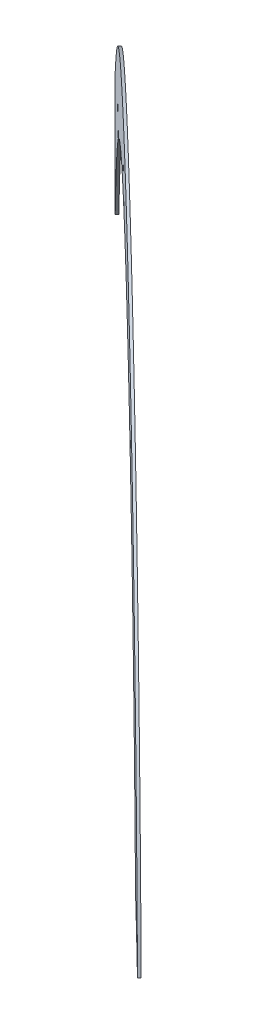
ISO-10303-21;
HEADER;
FILE_DESCRIPTION(('STEP AP214'),'2;1');
FILE_NAME('part.step','',(''),(''),'','','');
FILE_SCHEMA(('AUTOMOTIVE_DESIGN { 1 0 10303 214 1 1 1 1 }'));
ENDSEC;
DATA;
#1=APPLICATION_CONTEXT('core data for automotive mechanical design processes');
#2=APPLICATION_PROTOCOL_DEFINITION('international standard','automotive_design',2000,#1);
#3=PRODUCT_CONTEXT('',#1,'mechanical');
#4=PRODUCT('Part','Part','',(#3));
#5=PRODUCT_RELATED_PRODUCT_CATEGORY('part','',(#4));
#6=PRODUCT_DEFINITION_FORMATION('','',#4);
#7=PRODUCT_DEFINITION_CONTEXT('part definition',#1,'design');
#8=PRODUCT_DEFINITION('design','',#6,#7);
#9=PRODUCT_DEFINITION_SHAPE('','',#8);
#10=(LENGTH_UNIT() NAMED_UNIT(*) SI_UNIT(.MILLI.,.METRE.));
#11=(NAMED_UNIT(*) PLANE_ANGLE_UNIT() SI_UNIT($,.RADIAN.));
#12=(NAMED_UNIT(*) SI_UNIT($,.STERADIAN.) SOLID_ANGLE_UNIT());
#13=UNCERTAINTY_MEASURE_WITH_UNIT(LENGTH_MEASURE(1.E-05),#10,'distance_accuracy_value','');
#14=(GEOMETRIC_REPRESENTATION_CONTEXT(3) GLOBAL_UNCERTAINTY_ASSIGNED_CONTEXT((#13)) GLOBAL_UNIT_ASSIGNED_CONTEXT((#10,
#11,#12)) REPRESENTATION_CONTEXT('',''));
#15=CARTESIAN_POINT('',(0.,0.,0.));
#16=DIRECTION('',(0.,0.,1.));
#17=DIRECTION('',(1.,0.,0.));
#18=AXIS2_PLACEMENT_3D('',#15,#16,#17);
#19=CARTESIAN_POINT('',(-163.082588536067,0.,169.399508697981));
#20=DIRECTION('',(-0.693547097638021,0.,0.720411287639136));
#21=DIRECTION('',(0.720411287639136,0.,0.693547097638021));
#22=AXIS2_PLACEMENT_3D('',#19,#20,#21);
#23=CYLINDRICAL_SURFACE('',#22,298.478991770015);
#24=CARTESIAN_POINT('',(-164.227634794267,0.,170.588907733874));
#25=DIRECTION('',(-0.693547097638021,0.,0.720411287639136));
#26=DIRECTION('',(0.720411287639136,0.,0.693547097638021));
#27=AXIS2_PLACEMENT_3D('',#24,#25,#26);
#28=CIRCLE('',#27,298.478991770015);
#29=CARTESIAN_POINT('',(46.3376907785851,60.4918045135721,373.302236800156));
#30=VERTEX_POINT('',#29);
#31=CARTESIAN_POINT('',(-338.078037832069,175.652676961867,3.2213990358922));
#32=VERTEX_POINT('',#31);
#33=EDGE_CURVE('E38',#30,#32,#28,.T.);
#34=ORIENTED_EDGE('',*,*,#33,.F.);
#35=DIRECTION('',(0.693547097638021,0.,-0.720411287639136));
#36=VECTOR('',#35,1.);
#37=CARTESIAN_POINT('',(46.3376907785852,60.4918045135721,373.302236800156));
#38=LINE('',#37,#36);
#39=CARTESIAN_POINT('',(47.4827370367855,60.4918045135721,372.112837764264));
#40=VERTEX_POINT('',#39);
#41=EDGE_CURVE('E189',#30,#40,#38,.T.);
#42=ORIENTED_EDGE('',*,*,#41,.T.);
#43=CARTESIAN_POINT('',(-163.082588536067,0.,169.399508697981));
#44=DIRECTION('',(-0.693547097638021,0.,0.720411287639136));
#45=DIRECTION('',(0.720411287639136,0.,0.693547097638021));
#46=AXIS2_PLACEMENT_3D('',#43,#44,#45);
#47=CIRCLE('',#46,298.478991770015);
#48=CARTESIAN_POINT('',(-336.932991573868,175.652676961867,2.03199999999998));
#49=VERTEX_POINT('',#48);
#50=EDGE_CURVE('E280',#40,#49,#47,.T.);
#51=ORIENTED_EDGE('',*,*,#50,.T.);
#52=DIRECTION('',(-0.693547097638021,0.,0.720411287639136));
#53=VECTOR('',#52,1.);
#54=CARTESIAN_POINT('',(-336.932991573868,175.652676961867,2.03200000000001));
#55=LINE('',#54,#53);
#56=EDGE_CURVE('E178',#49,#32,#55,.T.);
#57=ORIENTED_EDGE('',*,*,#56,.T.);
#58=EDGE_LOOP('',(#34,#42,#51,#57));
#59=FACE_BOUND('',#58,.T.);
#60=ADVANCED_FACE('F31',(#59),#23,.T.);
#61=CARTESIAN_POINT('',(-163.082588536067,0.,169.399508697981));
#62=DIRECTION('',(-0.693547097638021,0.,0.720411287639136));
#63=DIRECTION('',(0.720411287639136,0.,0.693547097638021));
#64=AXIS2_PLACEMENT_3D('',#61,#62,#63);
#65=CYLINDRICAL_SURFACE('',#64,257.203991770015);
#66=DIRECTION('',(0.693547097638021,0.,-0.720411287639136));
#67=VECTOR('',#66,1.);
#68=CARTESIAN_POINT('',(12.9939765678767,75.0839301911765,341.201912149368));
#69=LINE('',#68,#67);
#70=CARTESIAN_POINT('',(12.9939765678767,75.0839301911765,341.201912149368));
#71=VERTEX_POINT('',#70);
#72=CARTESIAN_POINT('',(14.139022826077,75.0839301911765,340.012513113476));
#73=VERTEX_POINT('',#72);
#74=EDGE_CURVE('E197',#71,#73,#69,.T.);
#75=ORIENTED_EDGE('',*,*,#74,.F.);
#76=CARTESIAN_POINT('',(-164.227634794267,0.,170.588907733874));
#77=DIRECTION('',(-0.693547097638021,0.,0.720411287639136));
#78=DIRECTION('',(0.720411287639136,0.,0.693547097638021));
#79=AXIS2_PLACEMENT_3D('',#76,#77,#78);
#80=CIRCLE('',#79,257.203991770015);
#81=CARTESIAN_POINT('',(-2.4980018054066E-13,119.106830955406,328.692481925197));
#82=VERTEX_POINT('',#81);
#83=EDGE_CURVE('E284',#71,#82,#80,.T.);
#84=ORIENTED_EDGE('',*,*,#83,.T.);
#85=DIRECTION('',(0.693547097638021,0.,-0.720411287639136));
#86=VECTOR('',#85,1.);
#87=CARTESIAN_POINT('',(-2.77555756156289E-13,119.106830955406,328.692481925197));
#88=LINE('',#87,#86);
#89=CARTESIAN_POINT('',(1.14504625820011,119.106830955406,327.503082889304));
#90=VERTEX_POINT('',#89);
#91=EDGE_CURVE('E380',#82,#90,#88,.T.);
#92=ORIENTED_EDGE('',*,*,#91,.T.);
#93=CARTESIAN_POINT('',(-163.082588536067,0.,169.399508697981));
#94=DIRECTION('',(-0.693547097638021,0.,0.720411287639136));
#95=DIRECTION('',(0.720411287639136,0.,0.693547097638021));
#96=AXIS2_PLACEMENT_3D('',#93,#94,#95);
#97=CIRCLE('',#96,257.203991770015);
#98=EDGE_CURVE('E183',#73,#90,#97,.T.);
#99=ORIENTED_EDGE('',*,*,#98,.F.);
#100=EDGE_LOOP('',(#75,#84,#92,#99));
#101=FACE_BOUND('',#100,.T.);
#102=ADVANCED_FACE('F261',(#101),#65,.F.);
#103=CARTESIAN_POINT('',(-163.082588536067,0.,169.399508697981));
#104=DIRECTION('',(-0.693547097638021,0.,0.720411287639136));
#105=DIRECTION('',(0.720411287639136,0.,0.693547097638021));
#106=AXIS2_PLACEMENT_3D('',#103,#104,#105);
#107=PLANE('',#106);
#108=CARTESIAN_POINT('',(-278.7952938408,200.885539681433,58.0017387006007));
#109=VERTEX_POINT('',#108);
#110=CARTESIAN_POINT('',(-331.248318602606,108.001151140404,7.5046910972765));
#111=VERTEX_POINT('',#110);
#112=EDGE_CURVE('E187',#109,#111,#97,.T.);
#113=ORIENTED_EDGE('',*,*,#112,.T.);
#114=DIRECTION('',(-0.701450777031492,0.227915173395404,-0.675293625868081));
#115=VECTOR('',#114,1.);
#116=CARTESIAN_POINT('',(-154.551730465137,50.5889493973883,177.612250442832));
#117=LINE('',#116,#115);
#118=CARTESIAN_POINT('',(-336.932991573868,109.84821335541,2.03199999999992));
#119=VERTEX_POINT('',#118);
#120=EDGE_CURVE('E185',#111,#119,#117,.T.);
#121=ORIENTED_EDGE('',*,*,#120,.T.);
#122=DIRECTION('',(0.,1.,0.));
#123=VECTOR('',#122,1.);
#124=CARTESIAN_POINT('',(-336.932991573868,0.,2.03200000000001));
#125=LINE('',#124,#123);
#126=EDGE_CURVE('E174',#119,#49,#125,.T.);
#127=ORIENTED_EDGE('',*,*,#126,.T.);
#128=ORIENTED_EDGE('',*,*,#50,.F.);
#129=CARTESIAN_POINT('',(1.14504625820033,0.,327.503082889305));
#130=DIRECTION('',(-0.693547097638021,0.,0.720411287639136));
#131=DIRECTION('',(-0.720411287639136,0.,-0.693547097638021));
#132=AXIS2_PLACEMENT_3D('',#129,#130,#131);
#133=ELLIPSE('',#132,105.772912373036,76.2);
#134=EDGE_CURVE('E400',#73,#40,#133,.F.);
#135=ORIENTED_EDGE('',*,*,#134,.F.);
#136=ORIENTED_EDGE('',*,*,#98,.T.);
#137=DIRECTION('',(0.,1.,0.));
#138=VECTOR('',#137,1.);
#139=CARTESIAN_POINT('',(1.14504625820008,0.,327.503082889304));
#140=LINE('',#139,#138);
#141=CARTESIAN_POINT('',(1.14504625820012,153.85068584765,327.503082889304));
#142=VERTEX_POINT('',#141);
#143=EDGE_CURVE('E370',#90,#142,#140,.T.);
#144=ORIENTED_EDGE('',*,*,#143,.T.);
#145=CARTESIAN_POINT('',(0.572523129099984,153.85068584765,326.951909189876));
#146=DIRECTION('',(-0.693547097638021,0.,0.720411287639136));
#147=DIRECTION('',(0.720411287639136,0.,0.693547097638021));
#148=AXIS2_PLACEMENT_3D('',#145,#146,#147);
#149=CIRCLE('',#148,0.79471704417121);
#150=CARTESIAN_POINT('',(-2.31955307493579E-13,153.85068584765,326.400735490448));
#151=VERTEX_POINT('',#150);
#152=EDGE_CURVE('E376',#142,#151,#149,.T.);
#153=ORIENTED_EDGE('',*,*,#152,.T.);
#154=DIRECTION('',(0.,-1.,0.));
#155=VECTOR('',#154,1.);
#156=CARTESIAN_POINT('',(0.,4.17063620840154E-13,326.400735490448));
#157=LINE('',#156,#155);
#158=CARTESIAN_POINT('',(-1.34303677970628E-13,122.10068584765,326.400735490448));
#159=VERTEX_POINT('',#158);
#160=EDGE_CURVE('E378',#151,#159,#157,.T.);
#161=ORIENTED_EDGE('',*,*,#160,.T.);
#162=CARTESIAN_POINT('',(-71.2756377694648,223.413832775681,257.782971505505));
#163=VERTEX_POINT('',#162);
#164=EDGE_CURVE('E283',#159,#163,#97,.T.);
#165=ORIENTED_EDGE('',*,*,#164,.T.);
#166=DIRECTION('',(-0.296188126760788,0.911573321638445,-0.285143249688621));
#167=VECTOR('',#166,1.);
#168=CARTESIAN_POINT('',(-26.4730330924004,85.5255939385098,300.914883752785));
#169=LINE('',#168,#167);
#170=CARTESIAN_POINT('',(-81.5457039240239,255.021846305267,247.895876874621));
#171=VERTEX_POINT('',#170);
#172=EDGE_CURVE('E344',#163,#171,#169,.T.);
#173=ORIENTED_EDGE('',*,*,#172,.T.);
#174=CARTESIAN_POINT('',(-82.1634388218282,254.635108028727,247.301177356675));
#175=DIRECTION('',(-0.693547097638021,0.,0.720411287639136));
#176=DIRECTION('',(0.720411287639136,0.,0.693547097638021));
#177=AXIS2_PLACEMENT_3D('',#174,#175,#176);
#178=CIRCLE('',#177,0.940654248463459);
#179=CARTESIAN_POINT('',(-82.7811737196327,254.248369752186,246.706477838729));
#180=VERTEX_POINT('',#179);
#181=EDGE_CURVE('E351',#171,#180,#178,.T.);
#182=ORIENTED_EDGE('',*,*,#181,.T.);
#183=DIRECTION('',(0.29618812676079,-0.911573321638444,0.285143249688622));
#184=VECTOR('',#183,1.);
#185=CARTESIAN_POINT('',(-27.708502888009,84.7521173854291,299.725484716893));
#186=LINE('',#185,#184);
#187=CARTESIAN_POINT('',(-73.2675602432636,224.968478176917,255.865327967533));
#188=VERTEX_POINT('',#187);
#189=EDGE_CURVE('E353',#180,#188,#186,.T.);
#190=ORIENTED_EDGE('',*,*,#189,.T.);
#191=CARTESIAN_POINT('',(-183.871257537417,255.580097273569,149.38605069555));
#192=VERTEX_POINT('',#191);
#193=EDGE_CURVE('E416',#188,#192,#97,.T.);
#194=ORIENTED_EDGE('',*,*,#193,.T.);
#195=DIRECTION('',(0.51156164963066,-0.704104205758041,0.492485478020414));
#196=VECTOR('',#195,1.);
#197=CARTESIAN_POINT('',(-81.3307482807189,114.445194216746,248.102816806148));
#198=LINE('',#197,#196);
#199=CARTESIAN_POINT('',(-197.305171885825,274.070294103877,136.4530880031));
#200=VERTEX_POINT('',#199);
#201=EDGE_CURVE('E327',#200,#192,#198,.T.);
#202=ORIENTED_EDGE('',*,*,#201,.F.);
#203=CARTESIAN_POINT('',(-197.92290678363,273.205521028032,135.858388485154));
#204=DIRECTION('',(-0.693547097638021,0.,0.720411287639136));
#205=DIRECTION('',(0.720411287639136,0.,0.693547097638021));
#206=AXIS2_PLACEMENT_3D('',#203,#204,#205);
#207=CIRCLE('',#206,1.21782445094457);
#208=CARTESIAN_POINT('',(-198.540641681434,272.340747952186,135.263688967208));
#209=VERTEX_POINT('',#208);
#210=EDGE_CURVE('E325',#209,#200,#207,.F.);
#211=ORIENTED_EDGE('',*,*,#210,.F.);
#212=DIRECTION('',(-0.511561649630659,0.704104205758043,-0.492485478020413));
#213=VECTOR('',#212,1.);
#214=CARTESIAN_POINT('',(-82.5662180763276,112.715648065053,246.913417770256));
#215=LINE('',#214,#213);
#216=CARTESIAN_POINT('',(-186.09621595238,255.21246536807,147.244061143831));
#217=VERTEX_POINT('',#216);
#218=EDGE_CURVE('E319',#217,#209,#215,.T.);
#219=ORIENTED_EDGE('',*,*,#218,.F.);
#220=CARTESIAN_POINT('',(-276.50004292002,203.392062881473,60.2113995454144));
#221=VERTEX_POINT('',#220);
#222=EDGE_CURVE('E292',#217,#221,#97,.T.);
#223=ORIENTED_EDGE('',*,*,#222,.T.);
#224=DIRECTION('',(-0.638267967412969,0.463728822589056,-0.614466907875994));
#225=VECTOR('',#224,1.);
#226=CARTESIAN_POINT('',(-127.271734922929,94.9713507393051,203.874972941085));
#227=LINE('',#226,#225);
#228=CARTESIAN_POINT('',(-290.888121899911,213.845614156663,46.3598530909002));
#229=VERTEX_POINT('',#228);
#230=EDGE_CURVE('E296',#221,#229,#227,.T.);
#231=ORIENTED_EDGE('',*,*,#230,.T.);
#232=CARTESIAN_POINT('',(-291.505856797715,212.207364527736,45.7651535729541));
#233=DIRECTION('',(-0.693547097638021,0.,0.720411287639136));
#234=DIRECTION('',(0.720411287639136,0.,0.693547097638021));
#235=AXIS2_PLACEMENT_3D('',#232,#233,#234);
#236=CIRCLE('',#235,1.84908782032938);
#237=CARTESIAN_POINT('',(-292.12359169552,210.569114898809,45.1704540550079));
#238=VERTEX_POINT('',#237);
#239=EDGE_CURVE('E297',#229,#238,#236,.T.);
#240=ORIENTED_EDGE('',*,*,#239,.T.);
#241=DIRECTION('',(0.638267967412969,-0.463728822589056,0.614466907875994));
#242=VECTOR('',#241,1.);
#243=CARTESIAN_POINT('',(-128.507204718538,91.6948514814512,202.685573905193));
#244=LINE('',#243,#242);
#245=EDGE_CURVE('E300',#238,#109,#244,.T.);
#246=ORIENTED_EDGE('',*,*,#245,.T.);
#247=EDGE_LOOP('',(#113,#121,#127,#128,#135,#136,#144,#153,#161,#165,#173,#182,#190,#194,#202,
#211,#219,#223,#231,#240,#246));
#248=FACE_BOUND('',#247,.T.);
#249=ADVANCED_FACE('F186',(#248),#107,.F.);
#250=CARTESIAN_POINT('',(-164.227634794267,0.,170.588907733874));
#251=DIRECTION('',(-0.693547097638021,0.,0.720411287639136));
#252=DIRECTION('',(0.720411287639136,0.,0.693547097638021));
#253=AXIS2_PLACEMENT_3D('',#250,#251,#252);
#254=PLANE('',#253);
#255=DIRECTION('',(-0.701450777031492,0.227915173395404,-0.675293625868081));
#256=VECTOR('',#255,1.);
#257=CARTESIAN_POINT('',(-155.696776723338,50.5889493973883,178.801649478724));
#258=LINE('',#257,#256);
#259=CARTESIAN_POINT('',(-332.393364860806,108.001151140404,8.69409013316871));
#260=VERTEX_POINT('',#259);
#261=CARTESIAN_POINT('',(-338.078037832069,109.84821335541,3.22139903589219));
#262=VERTEX_POINT('',#261);
#263=EDGE_CURVE('E45',#260,#262,#258,.T.);
#264=ORIENTED_EDGE('',*,*,#263,.F.);
#265=CARTESIAN_POINT('',(-279.940340099001,200.885539681433,59.1911377364929));
#266=VERTEX_POINT('',#265);
#267=EDGE_CURVE('E287',#266,#260,#80,.T.);
#268=ORIENTED_EDGE('',*,*,#267,.F.);
#269=DIRECTION('',(-0.638267967412969,0.463728822589056,-0.614466907875994));
#270=VECTOR('',#269,1.);
#271=CARTESIAN_POINT('',(-279.940340099001,200.885539681433,59.1911377364929));
#272=LINE('',#271,#270);
#273=CARTESIAN_POINT('',(-293.26863795372,210.569114898809,46.3598530909002));
#274=VERTEX_POINT('',#273);
#275=EDGE_CURVE('E315',#266,#274,#272,.T.);
#276=ORIENTED_EDGE('',*,*,#275,.T.);
#277=CARTESIAN_POINT('',(-292.650903055916,212.207364527736,46.9545526088463));
#278=DIRECTION('',(0.693547097638021,0.,-0.720411287639136));
#279=DIRECTION('',(-0.720411287639136,0.,-0.693547097638021));
#280=AXIS2_PLACEMENT_3D('',#277,#278,#279);
#281=CIRCLE('',#280,1.84908782032938);
#282=CARTESIAN_POINT('',(-292.033168158111,213.845614156663,47.5492521267924));
#283=VERTEX_POINT('',#282);
#284=EDGE_CURVE('E311',#274,#283,#281,.T.);
#285=ORIENTED_EDGE('',*,*,#284,.T.);
#286=DIRECTION('',(0.638267967412969,-0.463728822589056,0.614466907875993));
#287=VECTOR('',#286,1.);
#288=CARTESIAN_POINT('',(-277.645089178221,203.392062881473,61.4007985813066));
#289=LINE('',#288,#287);
#290=CARTESIAN_POINT('',(-277.645089178221,203.392062881473,61.4007985813066));
#291=VERTEX_POINT('',#290);
#292=EDGE_CURVE('E307',#283,#291,#289,.T.);
#293=ORIENTED_EDGE('',*,*,#292,.T.);
#294=CARTESIAN_POINT('',(-187.241262210581,255.21246536807,148.433460179723));
#295=VERTEX_POINT('',#294);
#296=EDGE_CURVE('E294',#295,#291,#80,.T.);
#297=ORIENTED_EDGE('',*,*,#296,.F.);
#298=DIRECTION('',(0.511561649630659,-0.704104205758043,0.492485478020413));
#299=VECTOR('',#298,1.);
#300=CARTESIAN_POINT('',(-187.241262210581,255.21246536807,148.433460179723));
#301=LINE('',#300,#299);
#302=CARTESIAN_POINT('',(-199.685687939634,272.340747952186,136.4530880031));
#303=VERTEX_POINT('',#302);
#304=EDGE_CURVE('E332',#303,#295,#301,.T.);
#305=ORIENTED_EDGE('',*,*,#304,.F.);
#306=CARTESIAN_POINT('',(-199.06795304183,273.205521028032,137.047787521046));
#307=DIRECTION('',(-0.693547097638021,0.,0.720411287639136));
#308=DIRECTION('',(-0.720411287639136,0.,-0.693547097638021));
#309=AXIS2_PLACEMENT_3D('',#306,#307,#308);
#310=CIRCLE('',#309,1.21782445094457);
#311=CARTESIAN_POINT('',(-198.450218144026,274.070294103877,137.642487038992));
#312=VERTEX_POINT('',#311);
#313=EDGE_CURVE('E336',#312,#303,#310,.T.);
#314=ORIENTED_EDGE('',*,*,#313,.F.);
#315=DIRECTION('',(-0.51156164963066,0.704104205758041,-0.492485478020414));
#316=VECTOR('',#315,1.);
#317=CARTESIAN_POINT('',(-185.016303795617,255.580097273569,150.575449731442));
#318=LINE('',#317,#316);
#319=CARTESIAN_POINT('',(-185.016303795617,255.580097273569,150.575449731442));
#320=VERTEX_POINT('',#319);
#321=EDGE_CURVE('E340',#320,#312,#318,.T.);
#322=ORIENTED_EDGE('',*,*,#321,.F.);
#323=CARTESIAN_POINT('',(-74.4126065014641,224.968478176917,257.054727003425));
#324=VERTEX_POINT('',#323);
#325=EDGE_CURVE('E293',#324,#320,#80,.T.);
#326=ORIENTED_EDGE('',*,*,#325,.F.);
#327=DIRECTION('',(-0.29618812676079,0.911573321638444,-0.285143249688622));
#328=VECTOR('',#327,1.);
#329=CARTESIAN_POINT('',(-74.4126065014641,224.968478176917,257.054727003425));
#330=LINE('',#329,#328);
#331=CARTESIAN_POINT('',(-83.926219977833,254.248369752186,247.895876874621));
#332=VERTEX_POINT('',#331);
#333=EDGE_CURVE('E366',#324,#332,#330,.T.);
#334=ORIENTED_EDGE('',*,*,#333,.T.);
#335=CARTESIAN_POINT('',(-83.3084850800286,254.635108028727,248.490576392567));
#336=DIRECTION('',(0.693547097638021,0.,-0.720411287639136));
#337=DIRECTION('',(-0.720411287639136,0.,-0.693547097638021));
#338=AXIS2_PLACEMENT_3D('',#335,#336,#337);
#339=CIRCLE('',#338,0.940654248463459);
#340=CARTESIAN_POINT('',(-82.6907501822242,255.021846305267,249.085275910513));
#341=VERTEX_POINT('',#340);
#342=EDGE_CURVE('E362',#332,#341,#339,.T.);
#343=ORIENTED_EDGE('',*,*,#342,.T.);
#344=DIRECTION('',(0.296188126760788,-0.911573321638445,0.28514324968862));
#345=VECTOR('',#344,1.);
#346=CARTESIAN_POINT('',(-72.4206840276652,223.413832775681,258.972370541397));
#347=LINE('',#346,#345);
#348=CARTESIAN_POINT('',(-72.4206840276651,223.413832775681,258.972370541397));
#349=VERTEX_POINT('',#348);
#350=EDGE_CURVE('E358',#341,#349,#347,.T.);
#351=ORIENTED_EDGE('',*,*,#350,.T.);
#352=CARTESIAN_POINT('',(-1.14504625820053,122.10068584765,327.59013452634));
#353=VERTEX_POINT('',#352);
#354=EDGE_CURVE('E286',#353,#349,#80,.T.);
#355=ORIENTED_EDGE('',*,*,#354,.F.);
#356=DIRECTION('',(0.,1.,0.));
#357=VECTOR('',#356,1.);
#358=CARTESIAN_POINT('',(-1.14504625820053,122.10068584765,327.59013452634));
#359=LINE('',#358,#357);
#360=CARTESIAN_POINT('',(-1.14504625820059,153.85068584765,327.59013452634));
#361=VERTEX_POINT('',#360);
#362=EDGE_CURVE('E390',#353,#361,#359,.T.);
#363=ORIENTED_EDGE('',*,*,#362,.T.);
#364=CARTESIAN_POINT('',(-0.572523129100416,153.85068584765,328.141308225768));
#365=DIRECTION('',(0.693547097638021,0.,-0.720411287639136));
#366=DIRECTION('',(0.720411287639136,0.,0.693547097638021));
#367=AXIS2_PLACEMENT_3D('',#364,#365,#366);
#368=CIRCLE('',#367,0.79471704417121);
#369=CARTESIAN_POINT('',(-2.53161207275365E-13,153.85068584765,328.692481925197));
#370=VERTEX_POINT('',#369);
#371=EDGE_CURVE('E386',#361,#370,#368,.T.);
#372=ORIENTED_EDGE('',*,*,#371,.T.);
#373=DIRECTION('',(0.,-1.,0.));
#374=VECTOR('',#373,1.);
#375=CARTESIAN_POINT('',(-2.77555756156289E-13,119.106830955406,328.692481925197));
#376=LINE('',#375,#374);
#377=EDGE_CURVE('E382',#370,#82,#376,.T.);
#378=ORIENTED_EDGE('',*,*,#377,.T.);
#379=ORIENTED_EDGE('',*,*,#83,.F.);
#380=CARTESIAN_POINT('',(0.,0.,328.692481925197));
#381=DIRECTION('',(-0.693547097638021,0.,0.720411287639136));
#382=DIRECTION('',(-0.720411287639136,0.,-0.693547097638021));
#383=AXIS2_PLACEMENT_3D('',#380,#381,#382);
#384=ELLIPSE('',#383,105.772912373035,76.2);
#385=EDGE_CURVE('E182',#71,#30,#384,.F.);
#386=ORIENTED_EDGE('',*,*,#385,.T.);
#387=ORIENTED_EDGE('',*,*,#33,.T.);
#388=DIRECTION('',(0.,-1.,0.));
#389=VECTOR('',#388,1.);
#390=CARTESIAN_POINT('',(-338.078037832069,0.,3.22139903589219));
#391=LINE('',#390,#389);
#392=EDGE_CURVE('E394',#32,#262,#391,.T.);
#393=ORIENTED_EDGE('',*,*,#392,.T.);
#394=EDGE_LOOP('',(#264,#268,#276,#285,#293,#297,#305,#314,#322,#326,#334,#343,#351,#355,#363,
#372,#378,#379,#386,#387,#393));
#395=FACE_BOUND('',#394,.T.);
#396=ADVANCED_FACE('F260',(#395),#254,.T.);
#397=ORIENTED_EDGE('',*,*,#267,.T.);
#398=DIRECTION('',(0.693547097638021,0.,-0.720411287639136));
#399=VECTOR('',#398,1.);
#400=CARTESIAN_POINT('',(-840.224699090093,108.001151140404,536.196009817599));
#401=LINE('',#400,#399);
#402=EDGE_CURVE('E52',#260,#111,#401,.T.);
#403=ORIENTED_EDGE('',*,*,#402,.T.);
#404=ORIENTED_EDGE('',*,*,#112,.F.);
#405=DIRECTION('',(0.693547097638021,0.,-0.720411287639136));
#406=VECTOR('',#405,1.);
#407=CARTESIAN_POINT('',(-279.940340099001,200.885539681433,59.1911377364929));
#408=LINE('',#407,#406);
#409=EDGE_CURVE('E316',#266,#109,#408,.T.);
#410=ORIENTED_EDGE('',*,*,#409,.F.);
#411=EDGE_LOOP('',(#397,#403,#404,#410));
#412=FACE_BOUND('',#411,.T.);
#413=ADVANCED_FACE('F256',(#412),#65,.F.);
#414=ORIENTED_EDGE('',*,*,#164,.F.);
#415=DIRECTION('',(0.693547097638021,0.,-0.720411287639136));
#416=VECTOR('',#415,1.);
#417=CARTESIAN_POINT('',(-1.14504625820053,122.10068584765,327.59013452634));
#418=LINE('',#417,#416);
#419=EDGE_CURVE('E391',#353,#159,#418,.T.);
#420=ORIENTED_EDGE('',*,*,#419,.F.);
#421=ORIENTED_EDGE('',*,*,#354,.T.);
#422=DIRECTION('',(0.693547097638021,0.,-0.720411287639136));
#423=VECTOR('',#422,1.);
#424=CARTESIAN_POINT('',(-72.4206840276652,223.413832775681,258.972370541397));
#425=LINE('',#424,#423);
#426=EDGE_CURVE('E355',#349,#163,#425,.T.);
#427=ORIENTED_EDGE('',*,*,#426,.T.);
#428=EDGE_LOOP('',(#414,#420,#421,#427));
#429=FACE_BOUND('',#428,.T.);
#430=ADVANCED_FACE('F259',(#429),#65,.F.);
#431=DIRECTION('',(0.693547097638021,0.,-0.720411287639136));
#432=VECTOR('',#431,1.);
#433=CARTESIAN_POINT('',(-187.241262210581,255.21246536807,148.433460179723));
#434=LINE('',#433,#432);
#435=EDGE_CURVE('E330',#295,#217,#434,.T.);
#436=ORIENTED_EDGE('',*,*,#435,.F.);
#437=ORIENTED_EDGE('',*,*,#296,.T.);
#438=DIRECTION('',(0.693547097638021,0.,-0.720411287639136));
#439=VECTOR('',#438,1.);
#440=CARTESIAN_POINT('',(-277.645089178221,203.392062881473,61.4007985813066));
#441=LINE('',#440,#439);
#442=EDGE_CURVE('E304',#291,#221,#441,.T.);
#443=ORIENTED_EDGE('',*,*,#442,.T.);
#444=ORIENTED_EDGE('',*,*,#222,.F.);
#445=EDGE_LOOP('',(#436,#437,#443,#444));
#446=FACE_BOUND('',#445,.T.);
#447=ADVANCED_FACE('F425',(#446),#65,.F.);
#448=ORIENTED_EDGE('',*,*,#193,.F.);
#449=DIRECTION('',(0.693547097638021,0.,-0.720411287639136));
#450=VECTOR('',#449,1.);
#451=CARTESIAN_POINT('',(-74.4126065014641,224.968478176917,257.054727003425));
#452=LINE('',#451,#450);
#453=EDGE_CURVE('E367',#324,#188,#452,.T.);
#454=ORIENTED_EDGE('',*,*,#453,.F.);
#455=ORIENTED_EDGE('',*,*,#325,.T.);
#456=DIRECTION('',(0.693547097638021,0.,-0.720411287639136));
#457=VECTOR('',#456,1.);
#458=CARTESIAN_POINT('',(-185.016303795617,255.580097273569,150.575449731442));
#459=LINE('',#458,#457);
#460=EDGE_CURVE('E341',#320,#192,#459,.T.);
#461=ORIENTED_EDGE('',*,*,#460,.T.);
#462=EDGE_LOOP('',(#448,#454,#455,#461));
#463=FACE_BOUND('',#462,.T.);
#464=ADVANCED_FACE('F254',(#463),#65,.F.);
#465=CARTESIAN_POINT('',(-277.645089178221,203.392062881473,61.4007985813066));
#466=DIRECTION('',(0.334075478196763,0.885977188814795,0.321617778997737));
#467=DIRECTION('',(-0.935690834506648,0.352821005922626,0.));
#468=AXIS2_PLACEMENT_3D('',#465,#466,#467);
#469=PLANE('',#468);
#470=ORIENTED_EDGE('',*,*,#230,.F.);
#471=ORIENTED_EDGE('',*,*,#442,.F.);
#472=ORIENTED_EDGE('',*,*,#292,.F.);
#473=DIRECTION('',(0.693547097638021,0.,-0.720411287639136));
#474=VECTOR('',#473,1.);
#475=CARTESIAN_POINT('',(-292.033168158111,213.845614156663,47.5492521267924));
#476=LINE('',#475,#474);
#477=EDGE_CURVE('E308',#283,#229,#476,.T.);
#478=ORIENTED_EDGE('',*,*,#477,.T.);
#479=EDGE_LOOP('',(#470,#471,#472,#478));
#480=FACE_BOUND('',#479,.T.);
#481=ADVANCED_FACE('F250',(#480),#469,.F.);
#482=CARTESIAN_POINT('',(-292.650903055916,212.207364527736,46.9545526088463));
#483=DIRECTION('',(0.693547097638021,0.,-0.720411287639136));
#484=DIRECTION('',(-0.720411287639136,0.,-0.693547097638021));
#485=AXIS2_PLACEMENT_3D('',#482,#483,#484);
#486=CYLINDRICAL_SURFACE('',#485,1.84908782032938);
#487=ORIENTED_EDGE('',*,*,#239,.F.);
#488=ORIENTED_EDGE('',*,*,#477,.F.);
#489=ORIENTED_EDGE('',*,*,#284,.F.);
#490=DIRECTION('',(0.693547097638021,0.,-0.720411287639136));
#491=VECTOR('',#490,1.);
#492=CARTESIAN_POINT('',(-293.26863795372,210.569114898809,46.3598530909001));
#493=LINE('',#492,#491);
#494=EDGE_CURVE('E312',#274,#238,#493,.T.);
#495=ORIENTED_EDGE('',*,*,#494,.T.);
#496=EDGE_LOOP('',(#487,#488,#489,#495));
#497=FACE_BOUND('',#496,.T.);
#498=ADVANCED_FACE('F246',(#497),#486,.F.);
#499=CARTESIAN_POINT('',(-279.940340099001,200.885539681433,59.1911377364929));
#500=DIRECTION('',(-0.334075478196762,-0.885977188814796,-0.321617778997736));
#501=DIRECTION('',(0.935690834506648,-0.352821005922625,0.));
#502=AXIS2_PLACEMENT_3D('',#499,#500,#501);
#503=PLANE('',#502);
#504=ORIENTED_EDGE('',*,*,#245,.F.);
#505=ORIENTED_EDGE('',*,*,#494,.F.);
#506=ORIENTED_EDGE('',*,*,#275,.F.);
#507=ORIENTED_EDGE('',*,*,#409,.T.);
#508=EDGE_LOOP('',(#504,#505,#506,#507));
#509=FACE_BOUND('',#508,.T.);
#510=ADVANCED_FACE('F242',(#509),#503,.F.);
#511=CARTESIAN_POINT('',(-187.241262210581,255.21246536807,148.433460179723));
#512=DIRECTION('',(0.507244617502283,0.710096660627154,0.488329428338214));
#513=DIRECTION('',(-0.813715738499671,0.581263018708343,0.));
#514=AXIS2_PLACEMENT_3D('',#511,#512,#513);
#515=PLANE('',#514);
#516=ORIENTED_EDGE('',*,*,#435,.T.);
#517=ORIENTED_EDGE('',*,*,#218,.T.);
#518=DIRECTION('',(0.693547097638021,0.,-0.720411287639136));
#519=VECTOR('',#518,1.);
#520=CARTESIAN_POINT('',(-199.685687939634,272.340747952186,136.4530880031));
#521=LINE('',#520,#519);
#522=EDGE_CURVE('E333',#303,#209,#521,.T.);
#523=ORIENTED_EDGE('',*,*,#522,.F.);
#524=ORIENTED_EDGE('',*,*,#304,.T.);
#525=EDGE_LOOP('',(#516,#517,#523,#524));
#526=FACE_BOUND('',#525,.T.);
#527=ADVANCED_FACE('F238',(#526),#515,.T.);
#528=CARTESIAN_POINT('',(-199.06795304183,273.205521028032,137.047787521046));
#529=DIRECTION('',(0.693547097638021,0.,-0.720411287639136));
#530=DIRECTION('',(-0.720411287639136,0.,-0.693547097638021));
#531=AXIS2_PLACEMENT_3D('',#528,#529,#530);
#532=CYLINDRICAL_SURFACE('',#531,1.21782445094457);
#533=ORIENTED_EDGE('',*,*,#522,.T.);
#534=ORIENTED_EDGE('',*,*,#210,.T.);
#535=DIRECTION('',(0.693547097638021,0.,-0.720411287639136));
#536=VECTOR('',#535,1.);
#537=CARTESIAN_POINT('',(-198.450218144026,274.070294103877,137.642487038992));
#538=LINE('',#537,#536);
#539=EDGE_CURVE('E337',#312,#200,#538,.T.);
#540=ORIENTED_EDGE('',*,*,#539,.F.);
#541=ORIENTED_EDGE('',*,*,#313,.T.);
#542=EDGE_LOOP('',(#533,#534,#540,#541));
#543=FACE_BOUND('',#542,.T.);
#544=ADVANCED_FACE('F234',(#543),#532,.F.);
#545=CARTESIAN_POINT('',(-185.016303795617,255.580097273569,150.575449731442));
#546=DIRECTION('',(-0.507244617502282,-0.710096660627156,-0.488329428338213));
#547=DIRECTION('',(0.813715738499672,-0.581263018708341,0.));
#548=AXIS2_PLACEMENT_3D('',#545,#546,#547);
#549=PLANE('',#548);
#550=ORIENTED_EDGE('',*,*,#539,.T.);
#551=ORIENTED_EDGE('',*,*,#201,.T.);
#552=ORIENTED_EDGE('',*,*,#460,.F.);
#553=ORIENTED_EDGE('',*,*,#321,.T.);
#554=EDGE_LOOP('',(#550,#551,#552,#553));
#555=FACE_BOUND('',#554,.T.);
#556=ADVANCED_FACE('F230',(#555),#549,.T.);
#557=CARTESIAN_POINT('',(-72.4206840276652,223.413832775681,258.972370541397));
#558=DIRECTION('',(0.656707710419037,0.411137543015779,0.632219031506593));
#559=DIRECTION('',(0.69354709763802,0.,-0.720411287639136));
#560=AXIS2_PLACEMENT_3D('',#557,#558,#559);
#561=PLANE('',#560);
#562=ORIENTED_EDGE('',*,*,#172,.F.);
#563=ORIENTED_EDGE('',*,*,#426,.F.);
#564=ORIENTED_EDGE('',*,*,#350,.F.);
#565=DIRECTION('',(0.693547097638021,0.,-0.720411287639136));
#566=VECTOR('',#565,1.);
#567=CARTESIAN_POINT('',(-82.6907501822242,255.021846305267,249.085275910513));
#568=LINE('',#567,#566);
#569=EDGE_CURVE('E359',#341,#171,#568,.T.);
#570=ORIENTED_EDGE('',*,*,#569,.T.);
#571=EDGE_LOOP('',(#562,#563,#564,#570));
#572=FACE_BOUND('',#571,.T.);
#573=ADVANCED_FACE('F226',(#572),#561,.F.);
#574=CARTESIAN_POINT('',(-83.3084850800286,254.635108028727,248.490576392567));
#575=DIRECTION('',(0.693547097638021,0.,-0.720411287639136));
#576=DIRECTION('',(-0.720411287639136,0.,-0.693547097638021));
#577=AXIS2_PLACEMENT_3D('',#574,#575,#576);
#578=CYLINDRICAL_SURFACE('',#577,0.940654248463459);
#579=ORIENTED_EDGE('',*,*,#181,.F.);
#580=ORIENTED_EDGE('',*,*,#569,.F.);
#581=ORIENTED_EDGE('',*,*,#342,.F.);
#582=DIRECTION('',(0.693547097638021,0.,-0.720411287639136));
#583=VECTOR('',#582,1.);
#584=CARTESIAN_POINT('',(-83.926219977833,254.248369752186,247.895876874621));
#585=LINE('',#584,#583);
#586=EDGE_CURVE('E363',#332,#180,#585,.T.);
#587=ORIENTED_EDGE('',*,*,#586,.T.);
#588=EDGE_LOOP('',(#579,#580,#581,#587));
#589=FACE_BOUND('',#588,.T.);
#590=ADVANCED_FACE('F222',(#589),#578,.F.);
#591=CARTESIAN_POINT('',(-74.4126065014641,224.968478176917,257.054727003425));
#592=DIRECTION('',(-0.656707710419036,-0.411137543015781,-0.632219031506593));
#593=DIRECTION('',(-0.69354709763802,0.,0.720411287639136));
#594=AXIS2_PLACEMENT_3D('',#591,#592,#593);
#595=PLANE('',#594);
#596=ORIENTED_EDGE('',*,*,#189,.F.);
#597=ORIENTED_EDGE('',*,*,#586,.F.);
#598=ORIENTED_EDGE('',*,*,#333,.F.);
#599=ORIENTED_EDGE('',*,*,#453,.T.);
#600=EDGE_LOOP('',(#596,#597,#598,#599));
#601=FACE_BOUND('',#600,.T.);
#602=ADVANCED_FACE('F218',(#601),#595,.F.);
#603=CARTESIAN_POINT('',(-2.77555756156289E-13,119.106830955406,328.692481925197));
#604=DIRECTION('',(0.720411287639136,0.,0.693547097638021));
#605=DIRECTION('',(0.693547097638021,0.,-0.720411287639136));
#606=AXIS2_PLACEMENT_3D('',#603,#604,#605);
#607=PLANE('',#606);
#608=ORIENTED_EDGE('',*,*,#143,.F.);
#609=ORIENTED_EDGE('',*,*,#91,.F.);
#610=ORIENTED_EDGE('',*,*,#377,.F.);
#611=DIRECTION('',(0.693547097638021,0.,-0.720411287639136));
#612=VECTOR('',#611,1.);
#613=CARTESIAN_POINT('',(-2.77555756156289E-13,153.85068584765,328.692481925197));
#614=LINE('',#613,#612);
#615=EDGE_CURVE('E383',#370,#142,#614,.T.);
#616=ORIENTED_EDGE('',*,*,#615,.T.);
#617=EDGE_LOOP('',(#608,#609,#610,#616));
#618=FACE_BOUND('',#617,.T.);
#619=ADVANCED_FACE('F214',(#618),#607,.F.);
#620=CARTESIAN_POINT('',(-0.572523129100416,153.85068584765,328.141308225768));
#621=DIRECTION('',(0.693547097638021,0.,-0.720411287639136));
#622=DIRECTION('',(-0.720411287639136,0.,-0.693547097638021));
#623=AXIS2_PLACEMENT_3D('',#620,#621,#622);
#624=CYLINDRICAL_SURFACE('',#623,0.79471704417121);
#625=ORIENTED_EDGE('',*,*,#152,.F.);
#626=ORIENTED_EDGE('',*,*,#615,.F.);
#627=ORIENTED_EDGE('',*,*,#371,.F.);
#628=DIRECTION('',(0.693547097638021,0.,-0.720411287639136));
#629=VECTOR('',#628,1.);
#630=CARTESIAN_POINT('',(-1.14504625820057,153.85068584765,327.59013452634));
#631=LINE('',#630,#629);
#632=EDGE_CURVE('E387',#361,#151,#631,.T.);
#633=ORIENTED_EDGE('',*,*,#632,.T.);
#634=EDGE_LOOP('',(#625,#626,#627,#633));
#635=FACE_BOUND('',#634,.T.);
#636=ADVANCED_FACE('F210',(#635),#624,.F.);
#637=CARTESIAN_POINT('',(-1.14504625820053,122.10068584765,327.59013452634));
#638=DIRECTION('',(-0.720411287639136,0.,-0.693547097638021));
#639=DIRECTION('',(-0.693547097638021,0.,0.720411287639136));
#640=AXIS2_PLACEMENT_3D('',#637,#638,#639);
#641=PLANE('',#640);
#642=ORIENTED_EDGE('',*,*,#160,.F.);
#643=ORIENTED_EDGE('',*,*,#632,.F.);
#644=ORIENTED_EDGE('',*,*,#362,.F.);
#645=ORIENTED_EDGE('',*,*,#419,.T.);
#646=EDGE_LOOP('',(#642,#643,#644,#645));
#647=FACE_BOUND('',#646,.T.);
#648=ADVANCED_FACE('F207',(#647),#641,.F.);
#649=CARTESIAN_POINT('',(-336.932991573868,175.652676961867,2.03200000000001));
#650=DIRECTION('',(-0.720411287639136,0.,-0.693547097638021));
#651=DIRECTION('',(-0.693547097638021,0.,0.720411287639136));
#652=AXIS2_PLACEMENT_3D('',#649,#650,#651);
#653=PLANE('',#652);
#654=DIRECTION('',(0.69354709763802,0.,-0.720411287639136));
#655=VECTOR('',#654,1.);
#656=CARTESIAN_POINT('',(-336.932991573868,109.84821335541,2.03200000000001));
#657=LINE('',#656,#655);
#658=EDGE_CURVE('E11',#262,#119,#657,.T.);
#659=ORIENTED_EDGE('',*,*,#658,.F.);
#660=ORIENTED_EDGE('',*,*,#392,.F.);
#661=ORIENTED_EDGE('',*,*,#56,.F.);
#662=ORIENTED_EDGE('',*,*,#126,.F.);
#663=EDGE_LOOP('',(#659,#660,#661,#662));
#664=FACE_BOUND('',#663,.T.);
#665=ADVANCED_FACE('F176',(#664),#653,.T.);
#666=CARTESIAN_POINT('',(0.,0.,328.692481925197));
#667=DIRECTION('',(-0.693547097638021,0.,0.720411287639136));
#668=DIRECTION('',(-0.720411287639136,0.,-0.693547097638021));
#669=AXIS2_PLACEMENT_3D('',#666,#667,#668);
#670=ELLIPSE('',#669,105.772912373036,76.2);
#671=DIRECTION('',(0.693547097638021,0.,-0.720411287639136));
#672=VECTOR('',#671,1.);
#673=SURFACE_OF_LINEAR_EXTRUSION('',#670,#672);
#674=ORIENTED_EDGE('',*,*,#74,.T.);
#675=ORIENTED_EDGE('',*,*,#134,.T.);
#676=ORIENTED_EDGE('',*,*,#41,.F.);
#677=ORIENTED_EDGE('',*,*,#385,.F.);
#678=EDGE_LOOP('',(#674,#675,#676,#677));
#679=FACE_BOUND('',#678,.T.);
#680=ADVANCED_FACE('F200',(#679),#673,.T.);
#681=CARTESIAN_POINT('',(-845.909372061355,109.84821335541,530.723318720323));
#682=DIRECTION('',(0.16419266353828,0.973680991770992,0.158069907016048));
#683=DIRECTION('',(-0.986078040132566,0.166283188471705,0.));
#684=AXIS2_PLACEMENT_3D('',#681,#682,#683);
#685=PLANE('',#684);
#686=ORIENTED_EDGE('',*,*,#120,.F.);
#687=ORIENTED_EDGE('',*,*,#402,.F.);
#688=ORIENTED_EDGE('',*,*,#263,.T.);
#689=ORIENTED_EDGE('',*,*,#658,.T.);
#690=EDGE_LOOP('',(#686,#687,#688,#689));
#691=FACE_BOUND('',#690,.T.);
#692=ADVANCED_FACE('F191',(#691),#685,.F.);
#693=CLOSED_SHELL('',(#60,#102,#249,#396,#413,#430,#447,#464,#481,#498,#510,#527,#544,#556,#573,
#590,#602,#619,#636,#648,#665,#680,#692));
#694=MANIFOLD_SOLID_BREP('B2',#693);
#695=ADVANCED_BREP_SHAPE_REPRESENTATION('',(#18,#694),#14);
#696=SHAPE_DEFINITION_REPRESENTATION(#9,#695);
ENDSEC;
END-ISO-10303-21;
